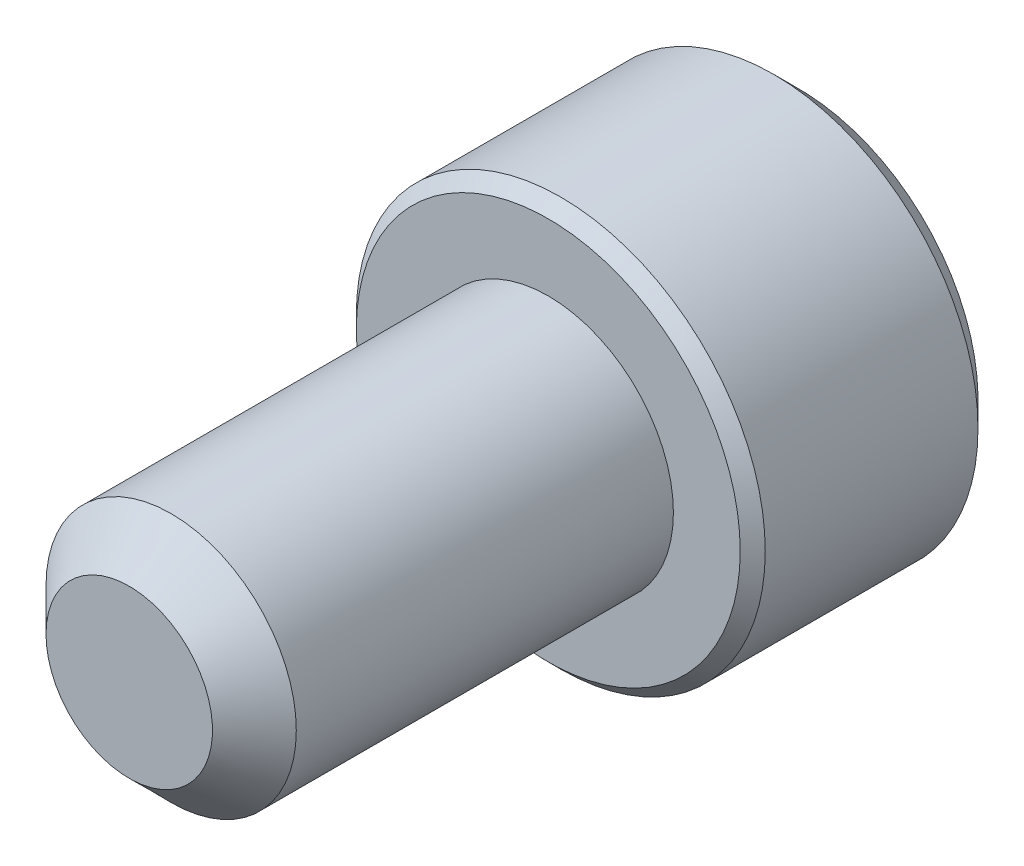
ISO-10303-21;
HEADER;
FILE_DESCRIPTION(('STEP AP214'),'2;1');
FILE_NAME('part.step','',(''),(''),'','','');
FILE_SCHEMA(('AUTOMOTIVE_DESIGN { 1 0 10303 214 1 1 1 1 }'));
ENDSEC;
DATA;
#1=APPLICATION_CONTEXT('core data for automotive mechanical design processes');
#2=APPLICATION_PROTOCOL_DEFINITION('international standard','automotive_design',2000,#1);
#3=PRODUCT_CONTEXT('',#1,'mechanical');
#4=PRODUCT('Part','Part','',(#3));
#5=PRODUCT_RELATED_PRODUCT_CATEGORY('part','',(#4));
#6=PRODUCT_DEFINITION_FORMATION('','',#4);
#7=PRODUCT_DEFINITION_CONTEXT('part definition',#1,'design');
#8=PRODUCT_DEFINITION('design','',#6,#7);
#9=PRODUCT_DEFINITION_SHAPE('','',#8);
#10=(LENGTH_UNIT() NAMED_UNIT(*) SI_UNIT(.MILLI.,.METRE.));
#11=(NAMED_UNIT(*) PLANE_ANGLE_UNIT() SI_UNIT($,.RADIAN.));
#12=(NAMED_UNIT(*) SI_UNIT($,.STERADIAN.) SOLID_ANGLE_UNIT());
#13=UNCERTAINTY_MEASURE_WITH_UNIT(LENGTH_MEASURE(1.E-05),#10,'distance_accuracy_value','');
#14=(GEOMETRIC_REPRESENTATION_CONTEXT(3) GLOBAL_UNCERTAINTY_ASSIGNED_CONTEXT((#13)) GLOBAL_UNIT_ASSIGNED_CONTEXT((#10,
#11,#12)) REPRESENTATION_CONTEXT('',''));
#15=CARTESIAN_POINT('',(0.,0.,0.));
#16=DIRECTION('',(0.,0.,1.));
#17=DIRECTION('',(1.,0.,0.));
#18=AXIS2_PLACEMENT_3D('',#15,#16,#17);
#19=CARTESIAN_POINT('',(0.,-1.3748153285078,-5.8213625));
#20=DIRECTION('',(-0.5,-0.866025403784439,0.));
#21=DIRECTION('',(0.866025403784439,-0.5,0.));
#22=AXIS2_PLACEMENT_3D('',#19,#20,#21);
#23=PLANE('',#22);
#24=CARTESIAN_POINT('',(-1.19062500001474,-0.687407664245389,-7.60729999995952));
#25=CARTESIAN_POINT('',(-1.14970263916378,-0.711034200298566,-7.58369613528999));
#26=CARTESIAN_POINT('',(-1.10809605275945,-0.735055774159164,-7.56147879632089));
#27=CARTESIAN_POINT('',(-1.02325595333944,-0.784038228397384,-7.52079979726755));
#28=CARTESIAN_POINT('',(-0.98001437643467,-0.809003764463537,-7.50236076356995));
#29=CARTESIAN_POINT('',(-0.89281986332562,-0.859345540078905,-7.47077457060107));
#30=CARTESIAN_POINT('',(-0.848889120877259,-0.884708966057167,-7.45754804212946));
#31=CARTESIAN_POINT('',(-0.76006074704934,-0.935994051598392,-7.43717007140658));
#32=CARTESIAN_POINT('',(-0.715165827353507,-0.961914145570028,-7.43000342342216));
#33=CARTESIAN_POINT('',(-0.637785345132547,-1.00658978781032,-7.42353686841741));
#34=CARTESIAN_POINT('',(-0.605399644533085,-1.02528768076932,-7.42257994963504));
#35=CARTESIAN_POINT('',(-0.540685248331174,-1.06265055483693,-7.42419472913948));
#36=CARTESIAN_POINT('',(-0.508356566900302,-1.08131552776359,-7.4267672068878));
#37=CARTESIAN_POINT('',(-0.444011322800891,-1.11846527176546,-7.43529207148953));
#38=CARTESIAN_POINT('',(-0.411995078567319,-1.13694985899215,-7.44124760127793));
#39=CARTESIAN_POINT('',(-0.348497138374104,-1.17361041185569,-7.45621782107217));
#40=CARTESIAN_POINT('',(-0.317015677884089,-1.19178624154409,-7.4652338237534));
#41=CARTESIAN_POINT('',(-0.236423425362924,-1.23831620023178,-7.4919792357716));
#42=CARTESIAN_POINT('',(-0.187819783517283,-1.26637752593496,-7.51171600111601));
#43=CARTESIAN_POINT('',(-0.092514044344822,-1.32140232010149,-7.55617313923926));
#44=CARTESIAN_POINT('',(-0.045806337004702,-1.34836902750754,-7.58087728917109));
#45=CARTESIAN_POINT('',(1.47390955299064E-11,-1.37481532851631,-7.60729999995952));
#46=B_SPLINE_CURVE_WITH_KNOTS('',3,(#24,#25,#26,#27,#28,#29,#30,#31,#32,#33,#34,#35,#36,#37,#38,
#39,#40,#41,#42,#43,#44,#45),.UNSPECIFIED.,.F.,.F.,(4,2,2,2,2,2,2,2,2,2,4),(0.,
0.158570945776655,0.318065397816435,0.475027617250887,0.631594801049637,0.743660160737506,
0.855750273863031,0.967944692049585,1.08018729276811,1.2583629104134,1.43596581388887),.UNSPECIFIED.);
#47=CARTESIAN_POINT('',(-1.19062500000866,-0.687407664257408,-7.60729999996027));
#48=VERTEX_POINT('',#47);
#49=CARTESIAN_POINT('',(-1.29196725261189E-12,-1.37481532851705,-7.60729999996027));
#50=VERTEX_POINT('',#49);
#51=EDGE_CURVE('E21',#48,#50,#46,.T.);
#52=ORIENTED_EDGE('',*,*,#51,.F.);
#53=DIRECTION('',(0.,0.,1.));
#54=VECTOR('',#53,1.);
#55=CARTESIAN_POINT('',(-1.190625,-0.687407664253898,-5.8213625));
#56=LINE('',#55,#54);
#57=CARTESIAN_POINT('',(-1.190625,-0.687407664253899,-5.8213625));
#58=VERTEX_POINT('',#57);
#59=EDGE_CURVE('E102',#48,#58,#56,.T.);
#60=ORIENTED_EDGE('',*,*,#59,.T.);
#61=DIRECTION('',(0.866025403784439,-0.5,0.));
#62=VECTOR('',#61,1.);
#63=CARTESIAN_POINT('',(0.,-1.3748153285078,-5.8213625));
#64=LINE('',#63,#62);
#65=CARTESIAN_POINT('',(0.,-1.3748153285078,-5.8213625));
#66=VERTEX_POINT('',#65);
#67=EDGE_CURVE('E75',#66,#58,#64,.F.);
#68=ORIENTED_EDGE('',*,*,#67,.F.);
#69=DIRECTION('',(0.,0.,1.));
#70=VECTOR('',#69,1.);
#71=CARTESIAN_POINT('',(0.,-1.3748153285078,-5.8213625));
#72=LINE('',#71,#70);
#73=EDGE_CURVE('E74',#66,#50,#72,.F.);
#74=ORIENTED_EDGE('',*,*,#73,.T.);
#75=EDGE_LOOP('',(#52,#60,#68,#74));
#76=FACE_BOUND('',#75,.T.);
#77=ADVANCED_FACE('F17',(#76),#23,.F.);
#78=CARTESIAN_POINT('',(1.190625,-0.687407664253898,-5.8213625));
#79=DIRECTION('',(0.5,-0.866025403784439,0.));
#80=DIRECTION('',(0.866025403784439,0.5,0.));
#81=AXIS2_PLACEMENT_3D('',#78,#79,#80);
#82=PLANE('',#81);
#83=CARTESIAN_POINT('',(-1.47389745819869E-11,-1.37481532851631,-7.60729999995952));
#84=CARTESIAN_POINT('',(0.0409223608362217,-1.35118879246313,-7.58369613528999));
#85=CARTESIAN_POINT('',(0.0825289472405448,-1.32716721860253,-7.56147879632089));
#86=CARTESIAN_POINT('',(0.16736904666056,-1.27818476436431,-7.52079979726755));
#87=CARTESIAN_POINT('',(0.21061062356533,-1.25321922829816,-7.50236076356995));
#88=CARTESIAN_POINT('',(0.297805136674379,-1.20287745268279,-7.47077457060107));
#89=CARTESIAN_POINT('',(0.341735879122741,-1.17751402670453,-7.45754804212946));
#90=CARTESIAN_POINT('',(0.430564252950659,-1.1262289411633,-7.43717007140658));
#91=CARTESIAN_POINT('',(0.475459172646492,-1.10030884719167,-7.43000342342216));
#92=CARTESIAN_POINT('',(0.552839654867452,-1.05563320495137,-7.42353686841741));
#93=CARTESIAN_POINT('',(0.585225355466913,-1.03693531199238,-7.42257994963504));
#94=CARTESIAN_POINT('',(0.649939751668824,-0.999572437924762,-7.42419472913948));
#95=CARTESIAN_POINT('',(0.682268433099697,-0.980907464998102,-7.4267672068878));
#96=CARTESIAN_POINT('',(0.746613677199107,-0.943757720996236,-7.43529207148953));
#97=CARTESIAN_POINT('',(0.77862992143268,-0.925273133769542,-7.44124760127793));
#98=CARTESIAN_POINT('',(0.842127861625894,-0.888612580906002,-7.45621782107217));
#99=CARTESIAN_POINT('',(0.87360932211591,-0.87043675121761,-7.4652338237534));
#100=CARTESIAN_POINT('',(0.954201574637075,-0.823906792529916,-7.4919792357716));
#101=CARTESIAN_POINT('',(1.00280521648272,-0.795845466826739,-7.51171600111601));
#102=CARTESIAN_POINT('',(1.09811095565518,-0.740820672660202,-7.55617313923926));
#103=CARTESIAN_POINT('',(1.1448186629953,-0.713853965254154,-7.58087728917109));
#104=CARTESIAN_POINT('',(1.19062500001474,-0.687407664245389,-7.60729999995952));
#105=B_SPLINE_CURVE_WITH_KNOTS('',3,(#83,#84,#85,#86,#87,#88,#89,#90,#91,#92,#93,#94,#95,#96,
#97,#98,#99,#100,#101,#102,#103,#104),.UNSPECIFIED.,.F.,.F.,(4,2,2,2,2,2,2,2,2,2,4),(0.,
0.158570945776654,0.318065397816434,0.475027617250886,0.631594801049636,0.743660160737505,
0.85575027386303,0.967944692049583,1.08018729276811,1.2583629104134,1.43596581388887),.UNSPECIFIED.);
#106=CARTESIAN_POINT('',(1.19062500000737,-0.687407664259645,-7.60729999996027));
#107=VERTEX_POINT('',#106);
#108=EDGE_CURVE('E82',#50,#107,#105,.T.);
#109=ORIENTED_EDGE('',*,*,#108,.F.);
#110=ORIENTED_EDGE('',*,*,#73,.F.);
#111=DIRECTION('',(-0.866025403784439,-0.5,0.));
#112=VECTOR('',#111,1.);
#113=CARTESIAN_POINT('',(1.190625,-0.687407664253899,-5.8213625));
#114=LINE('',#113,#112);
#115=CARTESIAN_POINT('',(1.190625,-0.687407664253899,-5.8213625));
#116=VERTEX_POINT('',#115);
#117=EDGE_CURVE('E262',#116,#66,#114,.T.);
#118=ORIENTED_EDGE('',*,*,#117,.F.);
#119=DIRECTION('',(0.,0.,1.));
#120=VECTOR('',#119,1.);
#121=CARTESIAN_POINT('',(1.190625,-0.687407664253898,-5.8213625));
#122=LINE('',#121,#120);
#123=EDGE_CURVE('E101',#116,#107,#122,.F.);
#124=ORIENTED_EDGE('',*,*,#123,.T.);
#125=EDGE_LOOP('',(#109,#110,#118,#124));
#126=FACE_BOUND('',#125,.T.);
#127=ADVANCED_FACE('F99',(#126),#82,.F.);
#128=CARTESIAN_POINT('',(-1.190625,-0.687407664253898,-5.8213625));
#129=DIRECTION('',(-1.,0.,0.));
#130=DIRECTION('',(0.,-1.,0.));
#131=AXIS2_PLACEMENT_3D('',#128,#129,#130);
#132=PLANE('',#131);
#133=CARTESIAN_POINT('',(-1.190625,0.687407664270918,-7.60729999995952));
#134=CARTESIAN_POINT('',(-1.190625,0.640463282069563,-7.58384971016085));
#135=CARTESIAN_POINT('',(-1.190625,0.59273899139373,-7.5617686860931));
#136=CARTESIAN_POINT('',(-1.190625,0.495406225249034,-7.52129372298424));
#137=CARTESIAN_POINT('',(-1.190625,0.445787629556659,-7.50292433634604));
#138=CARTESIAN_POINT('',(-1.190625,0.345116375786886,-7.47120435367277));
#139=CARTESIAN_POINT('',(-1.190625,0.294069215530455,-7.45783677245592));
#140=CARTESIAN_POINT('',(-1.190625,0.190855854751405,-7.43725680329601));
#141=CARTESIAN_POINT('',(-1.190625,0.138693633065745,-7.43002538133436));
#142=CARTESIAN_POINT('',(-1.190625,0.0719511129782222,-7.42519466153748));
#143=CARTESIAN_POINT('',(-1.190625,0.0575681066401037,-7.42441368529817));
#144=CARTESIAN_POINT('',(-1.190625,0.0287907386933872,-7.42337109572992));
#145=CARTESIAN_POINT('',(-1.190625,0.0143963875096987,-7.42310920026781));
#146=CARTESIAN_POINT('',(-1.190625,-0.0361321030415007,-7.42311085400087));
#147=CARTESIAN_POINT('',(-1.190625,-0.0722770331313745,-7.42476471374965));
#148=CARTESIAN_POINT('',(-1.190625,-0.144284982569752,-7.43128193069888));
#149=CARTESIAN_POINT('',(-1.190625,-0.180147787625371,-7.4361475264469));
#150=CARTESIAN_POINT('',(-1.190625,-0.287258251635275,-7.45525773762756));
#151=CARTESIAN_POINT('',(-1.190625,-0.357725297303735,-7.47401253561359));
#152=CARTESIAN_POINT('',(-1.190625,-0.471552892407799,-7.51238002149889));
#153=CARTESIAN_POINT('',(-1.190625,-0.515840765876029,-7.52944074656349));
#154=CARTESIAN_POINT('',(-1.190625,-0.602739573095866,-7.56641684237244));
#155=CARTESIAN_POINT('',(-1.190625,-0.645362139934235,-7.58630467577845));
#156=CARTESIAN_POINT('',(-1.190625,-0.687407664270918,-7.60729999995952));
#157=B_SPLINE_CURVE_WITH_KNOTS('',3,(#133,#134,#135,#136,#137,#138,#139,#140,#141,#142,#143,
#144,#145,#146,#147,#148,#149,#150,#151,#152,#153,#154,#155,#156),.UNSPECIFIED.,.F.,.F.,(4,2,2,
2,2,2,2,2,2,2,2,4),(0.,0.157535403105739,0.31608104146544,0.474083294588325,0.631593623098254,
0.674799715063236,0.717982317007914,0.826362160355007,0.934817623234313,1.15262451048446,
1.29491478053908,1.43590359049897),.UNSPECIFIED.);
#158=CARTESIAN_POINT('',(-1.19062500000737,0.687407664259645,-7.60729999996027));
#159=VERTEX_POINT('',#158);
#160=EDGE_CURVE('E59',#159,#48,#157,.T.);
#161=ORIENTED_EDGE('',*,*,#160,.F.);
#162=DIRECTION('',(0.,0.,1.));
#163=VECTOR('',#162,1.);
#164=CARTESIAN_POINT('',(-1.190625,0.687407664253898,-5.8213625));
#165=LINE('',#164,#163);
#166=CARTESIAN_POINT('',(-1.190625,0.687407664253899,-5.8213625));
#167=VERTEX_POINT('',#166);
#168=EDGE_CURVE('E239',#159,#167,#165,.T.);
#169=ORIENTED_EDGE('',*,*,#168,.T.);
#170=DIRECTION('',(0.,1.,0.));
#171=VECTOR('',#170,1.);
#172=CARTESIAN_POINT('',(-1.190625,2.06222299276169,-5.8213625));
#173=LINE('',#172,#171);
#174=EDGE_CURVE('E258',#58,#167,#173,.T.);
#175=ORIENTED_EDGE('',*,*,#174,.F.);
#176=ORIENTED_EDGE('',*,*,#59,.F.);
#177=EDGE_LOOP('',(#161,#169,#175,#176));
#178=FACE_BOUND('',#177,.T.);
#179=ADVANCED_FACE('F118',(#178),#132,.F.);
#180=CARTESIAN_POINT('',(1.190625,2.06222299276169,-5.8213625));
#181=DIRECTION('',(0.,0.,-1.));
#182=DIRECTION('',(-1.,0.,0.));
#183=AXIS2_PLACEMENT_3D('',#180,#181,#182);
#184=PLANE('',#183);
#185=ORIENTED_EDGE('',*,*,#67,.T.);
#186=ORIENTED_EDGE('',*,*,#174,.T.);
#187=DIRECTION('',(-0.866025403784439,-0.5,0.));
#188=VECTOR('',#187,1.);
#189=CARTESIAN_POINT('',(-1.190625,0.687407664253898,-5.8213625));
#190=LINE('',#189,#188);
#191=CARTESIAN_POINT('',(0.,1.3748153285078,-5.8213625));
#192=VERTEX_POINT('',#191);
#193=EDGE_CURVE('E139',#167,#192,#190,.F.);
#194=ORIENTED_EDGE('',*,*,#193,.T.);
#195=DIRECTION('',(-0.866025403784439,0.5,0.));
#196=VECTOR('',#195,1.);
#197=CARTESIAN_POINT('',(0.,1.3748153285078,-5.8213625));
#198=LINE('',#197,#196);
#199=CARTESIAN_POINT('',(1.190625,0.687407664253898,-5.8213625));
#200=VERTEX_POINT('',#199);
#201=EDGE_CURVE('E236',#192,#200,#198,.F.);
#202=ORIENTED_EDGE('',*,*,#201,.T.);
#203=DIRECTION('',(0.,1.,0.));
#204=VECTOR('',#203,1.);
#205=CARTESIAN_POINT('',(1.190625,0.687407664253898,-5.8213625));
#206=LINE('',#205,#204);
#207=EDGE_CURVE('E253',#200,#116,#206,.F.);
#208=ORIENTED_EDGE('',*,*,#207,.T.);
#209=ORIENTED_EDGE('',*,*,#117,.T.);
#210=EDGE_LOOP('',(#185,#186,#194,#202,#208,#209));
#211=FACE_BOUND('',#210,.T.);
#212=ADVANCED_FACE('F122',(#211),#184,.T.);
#213=CARTESIAN_POINT('',(1.190625,0.687407664253898,-5.8213625));
#214=DIRECTION('',(1.,0.,0.));
#215=DIRECTION('',(0.,1.,0.));
#216=AXIS2_PLACEMENT_3D('',#213,#214,#215);
#217=PLANE('',#216);
#218=CARTESIAN_POINT('',(1.190625,-0.687407664270917,-7.60729999995952));
#219=CARTESIAN_POINT('',(1.190625,-0.640154592164564,-7.58369613528999));
#220=CARTESIAN_POINT('',(1.190625,-0.59211144444337,-7.56147879632089));
#221=CARTESIAN_POINT('',(1.190625,-0.494146535966932,-7.52079979726756));
#222=CARTESIAN_POINT('',(1.190625,-0.444215463834627,-7.50236076356995));
#223=CARTESIAN_POINT('',(1.190625,-0.343531912603891,-7.47077457060107));
#224=CARTESIAN_POINT('',(1.190625,-0.292805060647367,-7.45754804212946));
#225=CARTESIAN_POINT('',(1.190625,-0.190234889564914,-7.43717007140658));
#226=CARTESIAN_POINT('',(1.190625,-0.138394701621641,-7.43000342342216));
#227=CARTESIAN_POINT('',(1.190625,-0.0490434171410509,-7.42353686841741));
#228=CARTESIAN_POINT('',(1.190625,-0.0116476312230634,-7.42257994963504));
#229=CARTESIAN_POINT('',(1.190625,0.0630781169121723,-7.42419472913948));
#230=CARTESIAN_POINT('',(1.190625,0.100408062765493,-7.4267672068878));
#231=CARTESIAN_POINT('',(1.190625,0.174707550769226,-7.43529207148953));
#232=CARTESIAN_POINT('',(1.190625,0.211676725222613,-7.44124760127793));
#233=CARTESIAN_POINT('',(1.190625,0.284997830949691,-7.45621782107217));
#234=CARTESIAN_POINT('',(1.190625,0.321349490326476,-7.4652338237534));
#235=CARTESIAN_POINT('',(1.190625,0.41440940770163,-7.49197923577154));
#236=CARTESIAN_POINT('',(1.190625,0.470532059107761,-7.51171600111585));
#237=CARTESIAN_POINT('',(1.190625,0.580581647440405,-7.55617313923888));
#238=CARTESIAN_POINT('',(1.190625,0.634515062252296,-7.58087728917058));
#239=CARTESIAN_POINT('',(1.190625,0.687407664269629,-7.60729999995888));
#240=B_SPLINE_CURVE_WITH_KNOTS('',3,(#218,#219,#220,#221,#222,#223,#224,#225,#226,#227,#228,
#229,#230,#231,#232,#233,#234,#235,#236,#237,#238,#239),.UNSPECIFIED.,.F.,.F.,(4,2,2,2,2,2,2,2,
2,2,4),(0.,0.158570945776651,0.318065397816427,0.475027617250882,0.631594801049636,
0.743660160737506,0.855750273863032,0.967944692049585,1.08018729276811,1.25836291041268,
1.43596581388743),.UNSPECIFIED.);
#241=CARTESIAN_POINT('',(1.19062500000681,0.687407664257831,-7.60729999995888));
#242=VERTEX_POINT('',#241);
#243=EDGE_CURVE('E39',#107,#242,#240,.T.);
#244=ORIENTED_EDGE('',*,*,#243,.F.);
#245=ORIENTED_EDGE('',*,*,#123,.F.);
#246=ORIENTED_EDGE('',*,*,#207,.F.);
#247=DIRECTION('',(0.,0.,1.));
#248=VECTOR('',#247,1.);
#249=CARTESIAN_POINT('',(1.190625,0.687407664253898,-5.8213625));
#250=LINE('',#249,#248);
#251=EDGE_CURVE('E232',#200,#242,#250,.F.);
#252=ORIENTED_EDGE('',*,*,#251,.T.);
#253=EDGE_LOOP('',(#244,#245,#246,#252));
#254=FACE_BOUND('',#253,.T.);
#255=ADVANCED_FACE('F126',(#254),#217,.F.);
#256=CARTESIAN_POINT('',(-1.190625,0.687407664253898,-5.8213625));
#257=DIRECTION('',(-0.5,0.866025403784439,0.));
#258=DIRECTION('',(-0.866025403784439,-0.5,0.));
#259=AXIS2_PLACEMENT_3D('',#256,#257,#258);
#260=PLANE('',#259);
#261=CARTESIAN_POINT('',(1.36231872988507E-11,1.37481532851566,-7.60729999995888));
#262=CARTESIAN_POINT('',(-0.0409223608372712,1.35118879246252,-7.58369613528941));
#263=CARTESIAN_POINT('',(-0.0825289472415261,1.32716721860196,-7.56147879632038));
#264=CARTESIAN_POINT('',(-0.167369046661398,1.27818476436383,-7.52079979726718));
#265=CARTESIAN_POINT('',(-0.210610623566094,1.25321922829772,-7.50236076356964));
#266=CARTESIAN_POINT('',(-0.29780513667499,1.20287745268244,-7.47077457060088));
#267=CARTESIAN_POINT('',(-0.341735879123273,1.17751402670422,-7.45754804212932));
#268=CARTESIAN_POINT('',(-0.430564252951029,1.12622894116309,-7.43717007140651));
#269=CARTESIAN_POINT('',(-0.475459172646779,1.1003088471915,-7.43000342342213));
#270=CARTESIAN_POINT('',(-0.55283965486765,1.05563320495126,-7.4235368684174));
#271=CARTESIAN_POINT('',(-0.585225355467108,1.03693531199227,-7.42257994963504));
#272=CARTESIAN_POINT('',(-0.649939751669011,0.999572437924654,-7.42419472913949));
#273=CARTESIAN_POINT('',(-0.682268433099879,0.980907464997997,-7.42676720688782));
#274=CARTESIAN_POINT('',(-0.746613677199281,0.943757720996135,-7.43529207148956));
#275=CARTESIAN_POINT('',(-0.778629921432849,0.925273133769444,-7.44124760127796));
#276=CARTESIAN_POINT('',(-0.842127861626056,0.888612580905909,-7.45621782107221));
#277=CARTESIAN_POINT('',(-0.873609322116067,0.870436751217519,-7.46523382375345));
#278=CARTESIAN_POINT('',(-0.954201574637201,0.823906792529843,-7.49197923577165));
#279=CARTESIAN_POINT('',(-1.00280521648282,0.795845466826681,-7.51171600111605));
#280=CARTESIAN_POINT('',(-1.09811095565523,0.740820672660174,-7.55617313923929));
#281=CARTESIAN_POINT('',(-1.14481866299532,0.71385396525414,-7.5808772891711));
#282=CARTESIAN_POINT('',(-1.19062500001474,0.687407664245389,-7.60729999995952));
#283=B_SPLINE_CURVE_WITH_KNOTS('',3,(#261,#262,#263,#264,#265,#266,#267,#268,#269,#270,#271,
#272,#273,#274,#275,#276,#277,#278,#279,#280,#281,#282),.UNSPECIFIED.,.F.,.F.,(4,2,2,2,2,2,2,2,
2,2,4),(0.,0.158570945776352,0.318065397815825,0.475027617249976,0.63159480104843,
0.743660160736285,0.855750273861797,0.967944692048339,1.08018729276685,1.25836291041205,
1.43596581388743),.UNSPECIFIED.);
#284=CARTESIAN_POINT('',(-1.84989494419728E-12,1.37481532851673,-7.60729999995995));
#285=VERTEX_POINT('',#284);
#286=EDGE_CURVE('E140',#285,#159,#283,.T.);
#287=ORIENTED_EDGE('',*,*,#286,.F.);
#288=DIRECTION('',(0.,0.,1.));
#289=VECTOR('',#288,1.);
#290=CARTESIAN_POINT('',(0.,1.3748153285078,-5.8213625));
#291=LINE('',#290,#289);
#292=EDGE_CURVE('E163',#285,#192,#291,.T.);
#293=ORIENTED_EDGE('',*,*,#292,.T.);
#294=ORIENTED_EDGE('',*,*,#193,.F.);
#295=ORIENTED_EDGE('',*,*,#168,.F.);
#296=EDGE_LOOP('',(#287,#293,#294,#295));
#297=FACE_BOUND('',#296,.T.);
#298=ADVANCED_FACE('F131',(#297),#260,.F.);
#299=CARTESIAN_POINT('',(0.,1.3748153285078,-5.8213625));
#300=DIRECTION('',(0.5,0.866025403784439,0.));
#301=DIRECTION('',(-0.866025403784439,0.5,0.));
#302=AXIS2_PLACEMENT_3D('',#299,#300,#301);
#303=PLANE('',#302);
#304=CARTESIAN_POINT('',(-1.57937141503361E-11,1.37481532850883,-7.60729999996195));
#305=CARTESIAN_POINT('',(0.0409223608363385,1.35118879246015,-7.58369613529061));
#306=CARTESIAN_POINT('',(0.0825289472409715,1.3271672186015,-7.56147879632087));
#307=CARTESIAN_POINT('',(0.167369046660793,1.27818476436496,-7.52079979726726));
#308=CARTESIAN_POINT('',(0.210610623565053,1.25321922829853,-7.50236076357002));
#309=CARTESIAN_POINT('',(0.297805136673245,1.20287745268324,-7.47077457060151));
#310=CARTESIAN_POINT('',(0.341735879121255,1.17751402670533,-7.45754804212991));
#311=CARTESIAN_POINT('',(0.430564252948422,1.12622894116465,-7.43717007140698));
#312=CARTESIAN_POINT('',(0.475459172643857,1.1003088471932,-7.43000342342253));
#313=CARTESIAN_POINT('',(0.552839654864332,1.05563320495317,-7.42353686841757));
#314=CARTESIAN_POINT('',(0.585225355463703,1.03693531199423,-7.42257994963508));
#315=CARTESIAN_POINT('',(0.649939751665438,0.999572437926719,-7.42419472913927));
#316=CARTESIAN_POINT('',(0.682268433096227,0.980907465000106,-7.42676720688747));
#317=CARTESIAN_POINT('',(0.746613677195491,0.943757720998323,-7.43529207148893));
#318=CARTESIAN_POINT('',(0.778629921429001,0.925273133771665,-7.44124760127719));
#319=CARTESIAN_POINT('',(0.842127861622102,0.888612580908192,-7.45621782107115));
#320=CARTESIAN_POINT('',(0.873609322112064,0.87043675121983,-7.46523382375225));
#321=CARTESIAN_POINT('',(0.954201574633594,0.823906792531926,-7.49197923577026));
#322=CARTESIAN_POINT('',(1.00280521647964,0.795845466828515,-7.51171600111469));
#323=CARTESIAN_POINT('',(1.09811095565287,0.740820672661537,-7.55617313923807));
#324=CARTESIAN_POINT('',(1.14481866299335,0.713853965255281,-7.58087728917002));
#325=CARTESIAN_POINT('',(1.19062500001313,0.687407664246318,-7.60729999995859));
#326=B_SPLINE_CURVE_WITH_KNOTS('',3,(#304,#305,#306,#307,#308,#309,#310,#311,#312,#313,#314,
#315,#316,#317,#318,#319,#320,#321,#322,#323,#324,#325),.UNSPECIFIED.,.F.,.F.,(4,2,2,2,2,2,2,2,
2,2,4),(0.,0.158570945775536,0.31806539781404,0.47502761724713,0.631594801044589,
0.743660160732147,0.855750273857356,0.967944692043632,1.08018729276188,1.2583629104085,
1.43596581388524),.UNSPECIFIED.);
#327=EDGE_CURVE('E156',#285,#242,#326,.T.);
#328=ORIENTED_EDGE('',*,*,#327,.T.);
#329=ORIENTED_EDGE('',*,*,#251,.F.);
#330=ORIENTED_EDGE('',*,*,#201,.F.);
#331=ORIENTED_EDGE('',*,*,#292,.F.);
#332=EDGE_LOOP('',(#328,#329,#330,#331));
#333=FACE_BOUND('',#332,.T.);
#334=ADVANCED_FACE('F165',(#333),#303,.F.);
#335=CARTESIAN_POINT('',(0.,0.,-7.60729999990417));
#336=DIRECTION('',(0.,0.,-1.));
#337=DIRECTION('',(-1.,0.,0.));
#338=AXIS2_PLACEMENT_3D('',#335,#336,#337);
#339=CONICAL_SURFACE('',#338,1.37481532846095,0.785398163397448);
#340=ORIENTED_EDGE('',*,*,#286,.T.);
#341=CARTESIAN_POINT('',(0.,0.,-7.60729999996101));
#342=DIRECTION('',(0.,0.,-1.));
#343=DIRECTION('',(-1.,0.,0.));
#344=AXIS2_PLACEMENT_3D('',#341,#342,#343);
#345=CIRCLE('',#344,1.3748153285178);
#346=EDGE_CURVE('E162',#285,#159,#345,.F.);
#347=ORIENTED_EDGE('',*,*,#346,.F.);
#348=EDGE_LOOP('',(#340,#347));
#349=FACE_BOUND('',#348,.T.);
#350=ADVANCED_FACE('F168',(#349),#339,.F.);
#351=CARTESIAN_POINT('',(0.,0.,-7.60729999990417));
#352=DIRECTION('',(0.,0.,-1.));
#353=DIRECTION('',(-1.,0.,0.));
#354=AXIS2_PLACEMENT_3D('',#351,#352,#353);
#355=CONICAL_SURFACE('',#354,1.37481532846095,0.785398163397448);
#356=ORIENTED_EDGE('',*,*,#160,.T.);
#357=CARTESIAN_POINT('',(0.,0.,-7.60729999996101));
#358=DIRECTION('',(0.,0.,-1.));
#359=DIRECTION('',(-1.,0.,0.));
#360=AXIS2_PLACEMENT_3D('',#357,#358,#359);
#361=CIRCLE('',#360,1.3748153285178);
#362=EDGE_CURVE('E92',#159,#48,#361,.F.);
#363=ORIENTED_EDGE('',*,*,#362,.F.);
#364=EDGE_LOOP('',(#356,#363));
#365=FACE_BOUND('',#364,.T.);
#366=ADVANCED_FACE('F172',(#365),#355,.F.);
#367=CARTESIAN_POINT('',(0.,0.,-7.60729999990417));
#368=DIRECTION('',(0.,0.,-1.));
#369=DIRECTION('',(-1.,0.,0.));
#370=AXIS2_PLACEMENT_3D('',#367,#368,#369);
#371=CONICAL_SURFACE('',#370,1.37481532846095,0.785398163397448);
#372=ORIENTED_EDGE('',*,*,#51,.T.);
#373=CARTESIAN_POINT('',(0.,0.,-7.60729999996101));
#374=DIRECTION('',(0.,0.,-1.));
#375=DIRECTION('',(-1.,0.,0.));
#376=AXIS2_PLACEMENT_3D('',#373,#374,#375);
#377=CIRCLE('',#376,1.3748153285178);
#378=EDGE_CURVE('E70',#48,#50,#377,.F.);
#379=ORIENTED_EDGE('',*,*,#378,.F.);
#380=EDGE_LOOP('',(#372,#379));
#381=FACE_BOUND('',#380,.T.);
#382=ADVANCED_FACE('F68',(#381),#371,.F.);
#383=CARTESIAN_POINT('',(0.,0.,-7.60729999990417));
#384=DIRECTION('',(0.,0.,-1.));
#385=DIRECTION('',(-1.,0.,0.));
#386=AXIS2_PLACEMENT_3D('',#383,#384,#385);
#387=CONICAL_SURFACE('',#386,1.37481532846095,0.785398163397448);
#388=ORIENTED_EDGE('',*,*,#108,.T.);
#389=CARTESIAN_POINT('',(0.,0.,-7.60729999996101));
#390=DIRECTION('',(0.,0.,-1.));
#391=DIRECTION('',(-1.,0.,0.));
#392=AXIS2_PLACEMENT_3D('',#389,#390,#391);
#393=CIRCLE('',#392,1.3748153285178);
#394=EDGE_CURVE('E90',#50,#107,#393,.F.);
#395=ORIENTED_EDGE('',*,*,#394,.F.);
#396=EDGE_LOOP('',(#388,#395));
#397=FACE_BOUND('',#396,.T.);
#398=ADVANCED_FACE('F95',(#397),#387,.F.);
#399=CARTESIAN_POINT('',(0.,0.,-7.60729999990417));
#400=DIRECTION('',(0.,0.,-1.));
#401=DIRECTION('',(-1.,0.,0.));
#402=AXIS2_PLACEMENT_3D('',#399,#400,#401);
#403=CONICAL_SURFACE('',#402,1.37481532846095,0.785398163397448);
#404=ORIENTED_EDGE('',*,*,#243,.T.);
#405=CARTESIAN_POINT('',(0.,0.,-7.60729999996101));
#406=DIRECTION('',(0.,0.,-1.));
#407=DIRECTION('',(-1.,0.,0.));
#408=AXIS2_PLACEMENT_3D('',#405,#406,#407);
#409=CIRCLE('',#408,1.3748153285178);
#410=EDGE_CURVE('E97',#107,#242,#409,.F.);
#411=ORIENTED_EDGE('',*,*,#410,.F.);
#412=EDGE_LOOP('',(#404,#411));
#413=FACE_BOUND('',#412,.T.);
#414=ADVANCED_FACE('F146',(#413),#403,.F.);
#415=CARTESIAN_POINT('',(0.,0.,-7.60729999990417));
#416=DIRECTION('',(0.,0.,-1.));
#417=DIRECTION('',(-1.,0.,0.));
#418=AXIS2_PLACEMENT_3D('',#415,#416,#417);
#419=CONICAL_SURFACE('',#418,1.37481532846095,0.785398163397448);
#420=ORIENTED_EDGE('',*,*,#327,.F.);
#421=CARTESIAN_POINT('',(0.,0.,-7.60729999996101));
#422=DIRECTION('',(0.,0.,-1.));
#423=DIRECTION('',(-1.,0.,0.));
#424=AXIS2_PLACEMENT_3D('',#421,#422,#423);
#425=CIRCLE('',#424,1.3748153285178);
#426=EDGE_CURVE('E227',#242,#285,#425,.F.);
#427=ORIENTED_EDGE('',*,*,#426,.F.);
#428=EDGE_LOOP('',(#420,#427));
#429=FACE_BOUND('',#428,.T.);
#430=ADVANCED_FACE('F150',(#429),#419,.F.);
#431=CARTESIAN_POINT('',(0.,0.,-7.6073));
#432=DIRECTION('',(0.,0.,-1.));
#433=DIRECTION('',(-1.,0.,0.));
#434=AXIS2_PLACEMENT_3D('',#431,#432,#433);
#435=PLANE('',#434);
#436=ORIENTED_EDGE('',*,*,#410,.T.);
#437=ORIENTED_EDGE('',*,*,#426,.T.);
#438=ORIENTED_EDGE('',*,*,#346,.T.);
#439=ORIENTED_EDGE('',*,*,#362,.T.);
#440=ORIENTED_EDGE('',*,*,#378,.T.);
#441=ORIENTED_EDGE('',*,*,#394,.T.);
#442=EDGE_LOOP('',(#436,#437,#438,#439,#440,#441));
#443=FACE_BOUND('',#442,.T.);
#444=CARTESIAN_POINT('',(0.,0.,-7.60729999996101));
#445=DIRECTION('',(0.,0.,1.));
#446=DIRECTION('',(0.,-1.,0.));
#447=AXIS2_PLACEMENT_3D('',#444,#445,#446);
#448=CIRCLE('',#447,2.03962000000502);
#449=CARTESIAN_POINT('',(0.,-2.03962000000502,-7.60729999996101));
#450=VERTEX_POINT('',#449);
#451=EDGE_CURVE('E218',#450,#450,#448,.T.);
#452=ORIENTED_EDGE('',*,*,#451,.F.);
#453=EDGE_LOOP('',(#452));
#454=FACE_BOUND('',#453,.T.);
#455=ADVANCED_FACE('F88',(#443,#454),#435,.T.);
#456=CARTESIAN_POINT('',(0.,0.,-7.32282000001305));
#457=DIRECTION('',(0.,0.,1.));
#458=DIRECTION('',(0.,-1.,0.));
#459=AXIS2_PLACEMENT_3D('',#456,#457,#458);
#460=CONICAL_SURFACE('',#459,2.32410000000982,0.785398163497356);
#461=ORIENTED_EDGE('',*,*,#451,.T.);
#462=EDGE_LOOP('',(#461));
#463=FACE_BOUND('',#462,.T.);
#464=CARTESIAN_POINT('',(0.,0.,-7.32282));
#465=DIRECTION('',(0.,0.,1.));
#466=DIRECTION('',(1.,0.,0.));
#467=AXIS2_PLACEMENT_3D('',#464,#465,#466);
#468=CIRCLE('',#467,2.3241);
#469=CARTESIAN_POINT('',(2.3241,0.,-7.32282));
#470=VERTEX_POINT('',#469);
#471=EDGE_CURVE('E221',#470,#470,#468,.T.);
#472=ORIENTED_EDGE('',*,*,#471,.F.);
#473=EDGE_LOOP('',(#472));
#474=FACE_BOUND('',#473,.T.);
#475=ADVANCED_FACE('F208',(#463,#474),#460,.T.);
#476=CARTESIAN_POINT('',(0.,0.,-7.6073));
#477=DIRECTION('',(0.,0.,1.));
#478=DIRECTION('',(1.,0.,0.));
#479=AXIS2_PLACEMENT_3D('',#476,#477,#478);
#480=CYLINDRICAL_SURFACE('',#479,2.3241);
#481=ORIENTED_EDGE('',*,*,#471,.T.);
#482=EDGE_LOOP('',(#481));
#483=FACE_BOUND('',#482,.T.);
#484=CARTESIAN_POINT('',(0.,0.,-4.90473999991536));
#485=DIRECTION('',(0.,0.,-1.));
#486=DIRECTION('',(-1.,0.,0.));
#487=AXIS2_PLACEMENT_3D('',#484,#485,#486);
#488=CIRCLE('',#487,2.32410000000982);
#489=CARTESIAN_POINT('',(-2.32410000000982,0.,-4.90473999991536));
#490=VERTEX_POINT('',#489);
#491=EDGE_CURVE('E222',#490,#490,#488,.F.);
#492=ORIENTED_EDGE('',*,*,#491,.F.);
#493=EDGE_LOOP('',(#492));
#494=FACE_BOUND('',#493,.T.);
#495=ADVANCED_FACE('F205',(#483,#494),#480,.T.);
#496=CARTESIAN_POINT('',(0.,0.,-4.90474000002905));
#497=DIRECTION('',(0.,0.,-1.));
#498=DIRECTION('',(-1.,0.,0.));
#499=AXIS2_PLACEMENT_3D('',#496,#497,#498);
#500=CONICAL_SURFACE('',#499,2.32410000006666,0.785398163197633);
#501=CARTESIAN_POINT('',(0.,0.,-4.7624999999698));
#502=DIRECTION('',(0.,0.,-1.));
#503=DIRECTION('',(-1.,0.,0.));
#504=AXIS2_PLACEMENT_3D('',#501,#502,#503);
#505=CIRCLE('',#504,2.18186000006426);
#506=CARTESIAN_POINT('',(-2.18186000006426,0.,-4.7624999999698));
#507=VERTEX_POINT('',#506);
#508=EDGE_CURVE('E225',#507,#507,#505,.T.);
#509=ORIENTED_EDGE('',*,*,#508,.T.);
#510=EDGE_LOOP('',(#509));
#511=FACE_BOUND('',#510,.T.);
#512=ORIENTED_EDGE('',*,*,#491,.T.);
#513=EDGE_LOOP('',(#512));
#514=FACE_BOUND('',#513,.T.);
#515=ADVANCED_FACE('F201',(#511,#514),#500,.T.);
#516=CARTESIAN_POINT('',(0.,0.,0.));
#517=DIRECTION('',(0.,0.,1.));
#518=DIRECTION('',(1.,0.,0.));
#519=AXIS2_PLACEMENT_3D('',#516,#517,#518);
#520=PLANE('',#519);
#521=CARTESIAN_POINT('',(0.,0.,0.));
#522=DIRECTION('',(0.,0.,-1.));
#523=DIRECTION('',(-1.,0.,0.));
#524=AXIS2_PLACEMENT_3D('',#521,#522,#523);
#525=CIRCLE('',#524,0.946150000004309);
#526=CARTESIAN_POINT('',(-0.946150000004309,0.,0.));
#527=VERTEX_POINT('',#526);
#528=EDGE_CURVE('E279',#527,#527,#525,.T.);
#529=ORIENTED_EDGE('',*,*,#528,.F.);
#530=EDGE_LOOP('',(#529));
#531=FACE_BOUND('',#530,.T.);
#532=ADVANCED_FACE('F197',(#531),#520,.T.);
#533=CARTESIAN_POINT('',(0.,0.,-4.7625));
#534=DIRECTION('',(0.,0.,-1.));
#535=DIRECTION('',(-1.,0.,0.));
#536=AXIS2_PLACEMENT_3D('',#533,#534,#535);
#537=PLANE('',#536);
#538=CARTESIAN_POINT('',(0.,0.,-4.7625));
#539=DIRECTION('',(0.,0.,1.));
#540=DIRECTION('',(1.,0.,0.));
#541=AXIS2_PLACEMENT_3D('',#538,#539,#540);
#542=CIRCLE('',#541,1.4224);
#543=CARTESIAN_POINT('',(1.4224,0.,-4.7625));
#544=VERTEX_POINT('',#543);
#545=EDGE_CURVE('E31',#544,#544,#542,.T.);
#546=ORIENTED_EDGE('',*,*,#545,.F.);
#547=EDGE_LOOP('',(#546));
#548=FACE_BOUND('',#547,.T.);
#549=ORIENTED_EDGE('',*,*,#508,.F.);
#550=EDGE_LOOP('',(#549));
#551=FACE_BOUND('',#550,.T.);
#552=ADVANCED_FACE('F190',(#548,#551),#537,.F.);
#553=CARTESIAN_POINT('',(0.,0.,-0.476250000019718));
#554=DIRECTION('',(0.,0.,-1.));
#555=DIRECTION('',(-1.,0.,0.));
#556=AXIS2_PLACEMENT_3D('',#553,#554,#555);
#557=CONICAL_SURFACE('',#556,1.42239999996718,0.78539816333777);
#558=CARTESIAN_POINT('',(0.,0.,-0.47625));
#559=DIRECTION('',(0.,0.,1.));
#560=DIRECTION('',(1.,0.,0.));
#561=AXIS2_PLACEMENT_3D('',#558,#559,#560);
#562=CIRCLE('',#561,1.4224);
#563=CARTESIAN_POINT('',(1.4224,0.,-0.47625));
#564=VERTEX_POINT('',#563);
#565=EDGE_CURVE('E11',#564,#564,#562,.F.);
#566=ORIENTED_EDGE('',*,*,#565,.F.);
#567=EDGE_LOOP('',(#566));
#568=FACE_BOUND('',#567,.T.);
#569=ORIENTED_EDGE('',*,*,#528,.T.);
#570=EDGE_LOOP('',(#569));
#571=FACE_BOUND('',#570,.T.);
#572=ADVANCED_FACE('F184',(#568,#571),#557,.T.);
#573=CARTESIAN_POINT('',(0.,0.,-4.7625));
#574=DIRECTION('',(0.,0.,1.));
#575=DIRECTION('',(1.,0.,0.));
#576=AXIS2_PLACEMENT_3D('',#573,#574,#575);
#577=CYLINDRICAL_SURFACE('',#576,1.4224);
#578=ORIENTED_EDGE('',*,*,#565,.T.);
#579=EDGE_LOOP('',(#578));
#580=FACE_BOUND('',#579,.T.);
#581=ORIENTED_EDGE('',*,*,#545,.T.);
#582=EDGE_LOOP('',(#581));
#583=FACE_BOUND('',#582,.T.);
#584=ADVANCED_FACE('F182',(#580,#583),#577,.T.);
#585=CLOSED_SHELL('',(#77,#127,#179,#212,#255,#298,#334,#350,#366,#382,#398,#414,#430,#455,#475,
#495,#515,#532,#552,#572,#584));
#586=MANIFOLD_SOLID_BREP('B1',#585);
#587=ADVANCED_BREP_SHAPE_REPRESENTATION('',(#18,#586),#14);
#588=SHAPE_DEFINITION_REPRESENTATION(#9,#587);
ENDSEC;
END-ISO-10303-21;
